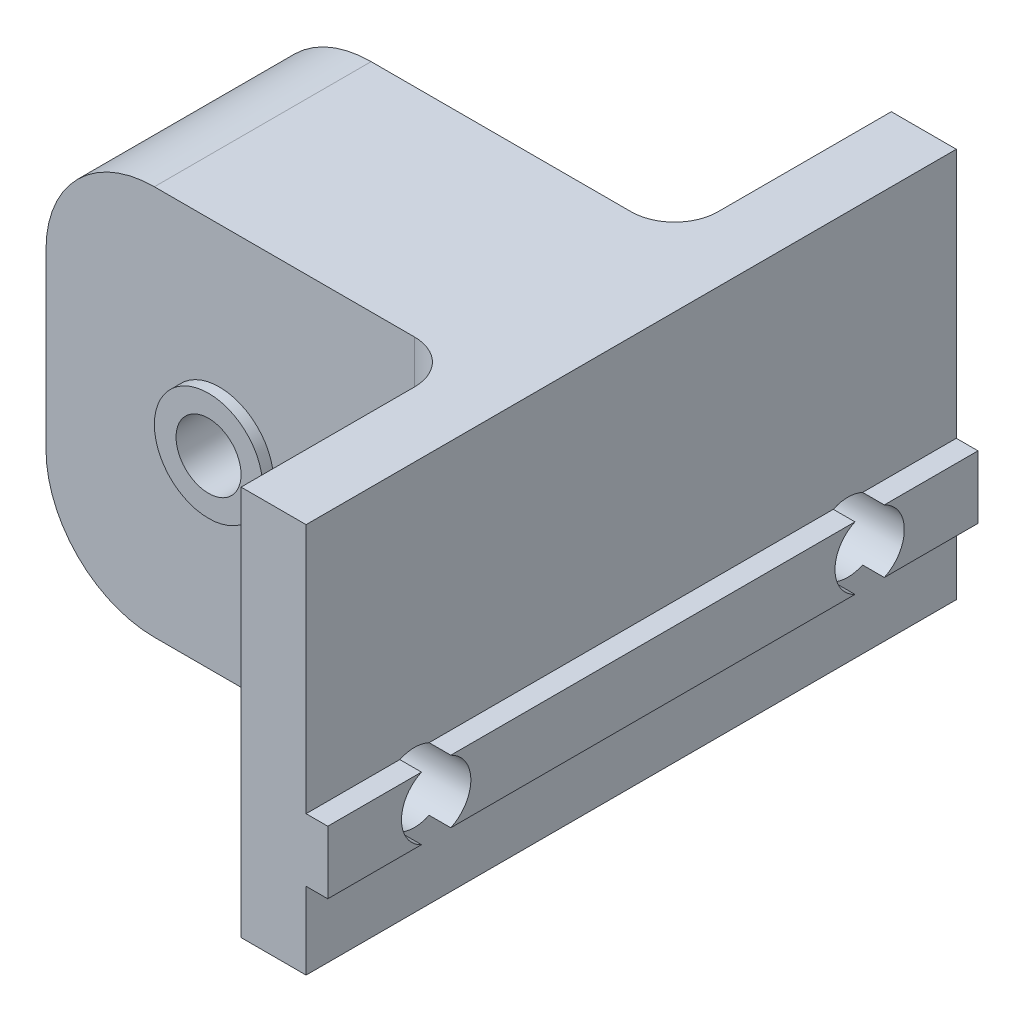
ISO-10303-21;
HEADER;
FILE_DESCRIPTION(('STEP AP214'),'2;1');
FILE_NAME('part.step','',(''),(''),'','','');
FILE_SCHEMA(('AUTOMOTIVE_DESIGN { 1 0 10303 214 1 1 1 1 }'));
ENDSEC;
DATA;
#1=APPLICATION_CONTEXT('core data for automotive mechanical design processes');
#2=APPLICATION_PROTOCOL_DEFINITION('international standard','automotive_design',2000,#1);
#3=PRODUCT_CONTEXT('',#1,'mechanical');
#4=PRODUCT('Part','Part','',(#3));
#5=PRODUCT_RELATED_PRODUCT_CATEGORY('part','',(#4));
#6=PRODUCT_DEFINITION_FORMATION('','',#4);
#7=PRODUCT_DEFINITION_CONTEXT('part definition',#1,'design');
#8=PRODUCT_DEFINITION('design','',#6,#7);
#9=PRODUCT_DEFINITION_SHAPE('','',#8);
#10=(LENGTH_UNIT() NAMED_UNIT(*) SI_UNIT(.MILLI.,.METRE.));
#11=(NAMED_UNIT(*) PLANE_ANGLE_UNIT() SI_UNIT($,.RADIAN.));
#12=(NAMED_UNIT(*) SI_UNIT($,.STERADIAN.) SOLID_ANGLE_UNIT());
#13=UNCERTAINTY_MEASURE_WITH_UNIT(LENGTH_MEASURE(1.E-05),#10,'distance_accuracy_value','');
#14=(GEOMETRIC_REPRESENTATION_CONTEXT(3) GLOBAL_UNCERTAINTY_ASSIGNED_CONTEXT((#13)) GLOBAL_UNIT_ASSIGNED_CONTEXT((#10,
#11,#12)) REPRESENTATION_CONTEXT('',''));
#15=CARTESIAN_POINT('',(0.,0.,0.));
#16=DIRECTION('',(0.,0.,1.));
#17=DIRECTION('',(1.,0.,0.));
#18=AXIS2_PLACEMENT_3D('',#15,#16,#17);
#19=CARTESIAN_POINT('',(-11.,-5.00000000000001,20.));
#20=DIRECTION('',(0.,0.,-1.));
#21=DIRECTION('',(-1.,0.,0.));
#22=AXIS2_PLACEMENT_3D('',#19,#20,#21);
#23=PLANE('',#22);
#24=DIRECTION('',(0.,1.,0.));
#25=VECTOR('',#24,1.);
#26=CARTESIAN_POINT('',(-11.,-5.00000000000001,20.));
#27=LINE('',#26,#25);
#28=CARTESIAN_POINT('',(-11.,0.,20.));
#29=VERTEX_POINT('',#28);
#30=CARTESIAN_POINT('',(-11.,7.99999999999999,20.));
#31=VERTEX_POINT('',#30);
#32=EDGE_CURVE('E360',#29,#31,#27,.T.);
#33=ORIENTED_EDGE('',*,*,#32,.F.);
#34=CARTESIAN_POINT('',(-6.,0.,20.));
#35=DIRECTION('',(0.,0.,-1.));
#36=DIRECTION('',(-1.,0.,0.));
#37=AXIS2_PLACEMENT_3D('',#34,#35,#36);
#38=CIRCLE('',#37,5.);
#39=CARTESIAN_POINT('',(-6.,-5.00000000000001,20.));
#40=VERTEX_POINT('',#39);
#41=EDGE_CURVE('E271',#29,#40,#38,.F.);
#42=ORIENTED_EDGE('',*,*,#41,.T.);
#43=DIRECTION('',(-1.,0.,0.));
#44=VECTOR('',#43,1.);
#45=CARTESIAN_POINT('',(-11.,-5.00000000000001,20.));
#46=LINE('',#45,#44);
#47=CARTESIAN_POINT('',(6.,-5.00000000000001,20.));
#48=VERTEX_POINT('',#47);
#49=EDGE_CURVE('E358',#48,#40,#46,.T.);
#50=ORIENTED_EDGE('',*,*,#49,.F.);
#51=DIRECTION('',(0.,1.,0.));
#52=VECTOR('',#51,1.);
#53=CARTESIAN_POINT('',(6.,13.,20.));
#54=LINE('',#53,#52);
#55=CARTESIAN_POINT('',(6.,13.,20.));
#56=VERTEX_POINT('',#55);
#57=EDGE_CURVE('E244',#48,#56,#54,.T.);
#58=ORIENTED_EDGE('',*,*,#57,.T.);
#59=DIRECTION('',(-1.,0.,0.));
#60=VECTOR('',#59,1.);
#61=CARTESIAN_POINT('',(-11.,13.,20.));
#62=LINE('',#61,#60);
#63=CARTESIAN_POINT('',(-6.,13.,20.));
#64=VERTEX_POINT('',#63);
#65=EDGE_CURVE('E367',#56,#64,#62,.T.);
#66=ORIENTED_EDGE('',*,*,#65,.T.);
#67=CARTESIAN_POINT('',(-6.,7.99999999999999,20.));
#68=DIRECTION('',(0.,0.,-1.));
#69=DIRECTION('',(-1.,0.,0.));
#70=AXIS2_PLACEMENT_3D('',#67,#68,#69);
#71=CIRCLE('',#70,5.);
#72=EDGE_CURVE('E54',#64,#31,#71,.F.);
#73=ORIENTED_EDGE('',*,*,#72,.T.);
#74=EDGE_LOOP('',(#33,#42,#50,#58,#66,#73));
#75=FACE_BOUND('',#74,.T.);
#76=CARTESIAN_POINT('',(-3.,3.99999999999999,20.));
#77=DIRECTION('',(0.,0.,-1.));
#78=DIRECTION('',(-1.,0.,0.));
#79=AXIS2_PLACEMENT_3D('',#76,#77,#78);
#80=CIRCLE('',#79,2.5);
#81=CARTESIAN_POINT('',(-5.5,3.99999999999999,20.));
#82=VERTEX_POINT('',#81);
#83=EDGE_CURVE('E11',#82,#82,#80,.F.);
#84=ORIENTED_EDGE('',*,*,#83,.F.);
#85=EDGE_LOOP('',(#84));
#86=FACE_BOUND('',#85,.T.);
#87=ADVANCED_FACE('F32',(#75,#86),#23,.F.);
#88=CARTESIAN_POINT('',(-11.,-5.00000000000001,10.));
#89=DIRECTION('',(0.,0.,1.));
#90=DIRECTION('',(1.,0.,0.));
#91=AXIS2_PLACEMENT_3D('',#88,#89,#90);
#92=PLANE('',#91);
#93=DIRECTION('',(1.,0.,0.));
#94=VECTOR('',#93,1.);
#95=CARTESIAN_POINT('',(-11.,-5.00000000000001,10.));
#96=LINE('',#95,#94);
#97=CARTESIAN_POINT('',(-6.,-5.00000000000001,10.));
#98=VERTEX_POINT('',#97);
#99=CARTESIAN_POINT('',(6.,-5.00000000000001,10.));
#100=VERTEX_POINT('',#99);
#101=EDGE_CURVE('E378',#98,#100,#96,.T.);
#102=ORIENTED_EDGE('',*,*,#101,.F.);
#103=CARTESIAN_POINT('',(-6.,0.,10.));
#104=DIRECTION('',(0.,0.,1.));
#105=DIRECTION('',(1.,0.,0.));
#106=AXIS2_PLACEMENT_3D('',#103,#104,#105);
#107=CIRCLE('',#106,5.);
#108=CARTESIAN_POINT('',(-11.,0.,10.));
#109=VERTEX_POINT('',#108);
#110=EDGE_CURVE('E263',#98,#109,#107,.F.);
#111=ORIENTED_EDGE('',*,*,#110,.T.);
#112=DIRECTION('',(0.,1.,0.));
#113=VECTOR('',#112,1.);
#114=CARTESIAN_POINT('',(-11.,-5.00000000000001,10.));
#115=LINE('',#114,#113);
#116=CARTESIAN_POINT('',(-11.,7.99999999999999,10.));
#117=VERTEX_POINT('',#116);
#118=EDGE_CURVE('E383',#109,#117,#115,.T.);
#119=ORIENTED_EDGE('',*,*,#118,.T.);
#120=CARTESIAN_POINT('',(-6.,7.99999999999999,10.));
#121=DIRECTION('',(0.,0.,1.));
#122=DIRECTION('',(1.,0.,0.));
#123=AXIS2_PLACEMENT_3D('',#120,#121,#122);
#124=CIRCLE('',#123,5.);
#125=CARTESIAN_POINT('',(-6.,13.,10.));
#126=VERTEX_POINT('',#125);
#127=EDGE_CURVE('E261',#117,#126,#124,.F.);
#128=ORIENTED_EDGE('',*,*,#127,.T.);
#129=DIRECTION('',(1.,0.,0.));
#130=VECTOR('',#129,1.);
#131=CARTESIAN_POINT('',(-11.,13.,10.));
#132=LINE('',#131,#130);
#133=CARTESIAN_POINT('',(6.,13.,10.));
#134=VERTEX_POINT('',#133);
#135=EDGE_CURVE('E376',#126,#134,#132,.T.);
#136=ORIENTED_EDGE('',*,*,#135,.T.);
#137=DIRECTION('',(0.,1.,0.));
#138=VECTOR('',#137,1.);
#139=CARTESIAN_POINT('',(6.,-5.00000000000001,10.));
#140=LINE('',#139,#138);
#141=EDGE_CURVE('E241',#134,#100,#140,.F.);
#142=ORIENTED_EDGE('',*,*,#141,.T.);
#143=EDGE_LOOP('',(#102,#111,#119,#128,#136,#142));
#144=FACE_BOUND('',#143,.T.);
#145=CARTESIAN_POINT('',(-3.,3.99999999999999,10.));
#146=DIRECTION('',(0.,0.,1.));
#147=DIRECTION('',(1.,0.,0.));
#148=AXIS2_PLACEMENT_3D('',#145,#146,#147);
#149=CIRCLE('',#148,2.5);
#150=CARTESIAN_POINT('',(-0.5,3.99999999999999,10.));
#151=VERTEX_POINT('',#150);
#152=EDGE_CURVE('E40',#151,#151,#149,.F.);
#153=ORIENTED_EDGE('',*,*,#152,.F.);
#154=EDGE_LOOP('',(#153));
#155=FACE_BOUND('',#154,.T.);
#156=ADVANCED_FACE('F278',(#144,#155),#92,.F.);
#157=CARTESIAN_POINT('',(12.,-1.45,30.));
#158=DIRECTION('',(0.,1.,0.));
#159=DIRECTION('',(-1.,0.,0.));
#160=AXIS2_PLACEMENT_3D('',#157,#158,#159);
#161=PLANE('',#160);
#162=DIRECTION('',(0.,0.,-1.));
#163=VECTOR('',#162,1.);
#164=CARTESIAN_POINT('',(12.,-1.45,30.));
#165=LINE('',#164,#163);
#166=CARTESIAN_POINT('',(12.,-1.45,4.32361253707657));
#167=VERTEX_POINT('',#166);
#168=CARTESIAN_POINT('',(12.,-1.45,0.));
#169=VERTEX_POINT('',#168);
#170=EDGE_CURVE('E224',#167,#169,#165,.T.);
#171=ORIENTED_EDGE('',*,*,#170,.F.);
#172=DIRECTION('',(-1.,0.,0.));
#173=VECTOR('',#172,1.);
#174=CARTESIAN_POINT('',(12.,-1.45,4.32361253707657));
#175=LINE('',#174,#173);
#176=CARTESIAN_POINT('',(11.,-1.45,4.32361253707657));
#177=VERTEX_POINT('',#176);
#178=EDGE_CURVE('E217',#167,#177,#175,.T.);
#179=ORIENTED_EDGE('',*,*,#178,.T.);
#180=DIRECTION('',(0.,0.,-1.));
#181=VECTOR('',#180,1.);
#182=CARTESIAN_POINT('',(11.,-1.45,30.));
#183=LINE('',#182,#181);
#184=CARTESIAN_POINT('',(11.,-1.45,0.));
#185=VERTEX_POINT('',#184);
#186=EDGE_CURVE('E227',#177,#185,#183,.T.);
#187=ORIENTED_EDGE('',*,*,#186,.T.);
#188=DIRECTION('',(1.,0.,0.));
#189=VECTOR('',#188,1.);
#190=CARTESIAN_POINT('',(12.,-1.45,0.));
#191=LINE('',#190,#189);
#192=EDGE_CURVE('E413',#185,#169,#191,.T.);
#193=ORIENTED_EDGE('',*,*,#192,.T.);
#194=EDGE_LOOP('',(#171,#179,#187,#193));
#195=FACE_BOUND('',#194,.T.);
#196=ADVANCED_FACE('F280',(#195),#161,.F.);
#197=CARTESIAN_POINT('',(12.,1.45,30.));
#198=DIRECTION('',(-1.,0.,0.));
#199=DIRECTION('',(0.,0.,1.));
#200=AXIS2_PLACEMENT_3D('',#197,#198,#199);
#201=PLANE('',#200);
#202=DIRECTION('',(0.,0.,-1.));
#203=VECTOR('',#202,1.);
#204=CARTESIAN_POINT('',(12.,1.45,30.));
#205=LINE('',#204,#203);
#206=CARTESIAN_POINT('',(12.,1.45,4.32361253707657));
#207=VERTEX_POINT('',#206);
#208=CARTESIAN_POINT('',(12.,1.45,0.));
#209=VERTEX_POINT('',#208);
#210=EDGE_CURVE('E430',#207,#209,#205,.T.);
#211=ORIENTED_EDGE('',*,*,#210,.F.);
#212=CARTESIAN_POINT('',(12.,0.,5.));
#213=DIRECTION('',(-1.,0.,0.));
#214=DIRECTION('',(0.,-1.,0.));
#215=AXIS2_PLACEMENT_3D('',#212,#213,#214);
#216=CIRCLE('',#215,1.6);
#217=EDGE_CURVE('E207',#207,#167,#216,.T.);
#218=ORIENTED_EDGE('',*,*,#217,.T.);
#219=ORIENTED_EDGE('',*,*,#170,.T.);
#220=DIRECTION('',(0.,1.,0.));
#221=VECTOR('',#220,1.);
#222=CARTESIAN_POINT('',(12.,1.45,0.));
#223=LINE('',#222,#221);
#224=EDGE_CURVE('E416',#169,#209,#223,.T.);
#225=ORIENTED_EDGE('',*,*,#224,.T.);
#226=EDGE_LOOP('',(#211,#218,#219,#225));
#227=FACE_BOUND('',#226,.T.);
#228=ADVANCED_FACE('F287',(#227),#201,.F.);
#229=CARTESIAN_POINT('',(11.,1.45,30.));
#230=DIRECTION('',(0.,-1.,0.));
#231=DIRECTION('',(1.,0.,0.));
#232=AXIS2_PLACEMENT_3D('',#229,#230,#231);
#233=PLANE('',#232);
#234=CARTESIAN_POINT('',(12.,1.45,24.3236125370766));
#235=VERTEX_POINT('',#234);
#236=CARTESIAN_POINT('',(12.,1.45,5.67638746292344));
#237=VERTEX_POINT('',#236);
#238=EDGE_CURVE('E435',#235,#237,#205,.T.);
#239=ORIENTED_EDGE('',*,*,#238,.T.);
#240=DIRECTION('',(-1.,0.,0.));
#241=VECTOR('',#240,1.);
#242=CARTESIAN_POINT('',(12.,1.45,5.67638746292344));
#243=LINE('',#242,#241);
#244=CARTESIAN_POINT('',(11.,1.45,5.67638746292344));
#245=VERTEX_POINT('',#244);
#246=EDGE_CURVE('E201',#237,#245,#243,.T.);
#247=ORIENTED_EDGE('',*,*,#246,.T.);
#248=DIRECTION('',(0.,0.,-1.));
#249=VECTOR('',#248,1.);
#250=CARTESIAN_POINT('',(11.,1.45,30.));
#251=LINE('',#250,#249);
#252=CARTESIAN_POINT('',(11.,1.45,24.3236125370766));
#253=VERTEX_POINT('',#252);
#254=EDGE_CURVE('E431',#253,#245,#251,.T.);
#255=ORIENTED_EDGE('',*,*,#254,.F.);
#256=DIRECTION('',(-1.,0.,0.));
#257=VECTOR('',#256,1.);
#258=CARTESIAN_POINT('',(12.,1.45,24.3236125370766));
#259=LINE('',#258,#257);
#260=EDGE_CURVE('E462',#253,#235,#259,.F.);
#261=ORIENTED_EDGE('',*,*,#260,.T.);
#262=EDGE_LOOP('',(#239,#247,#255,#261));
#263=FACE_BOUND('',#262,.T.);
#264=ADVANCED_FACE('F321',(#263),#233,.F.);
#265=CARTESIAN_POINT('',(11.,-1.45,24.3236125370766));
#266=VERTEX_POINT('',#265);
#267=CARTESIAN_POINT('',(11.,-1.45,5.67638746292344));
#268=VERTEX_POINT('',#267);
#269=EDGE_CURVE('E216',#266,#268,#183,.T.);
#270=ORIENTED_EDGE('',*,*,#269,.T.);
#271=DIRECTION('',(-1.,0.,0.));
#272=VECTOR('',#271,1.);
#273=CARTESIAN_POINT('',(12.,-1.45,5.67638746292343));
#274=LINE('',#273,#272);
#275=CARTESIAN_POINT('',(12.,-1.45,5.67638746292343));
#276=VERTEX_POINT('',#275);
#277=EDGE_CURVE('E198',#268,#276,#274,.F.);
#278=ORIENTED_EDGE('',*,*,#277,.T.);
#279=CARTESIAN_POINT('',(12.,-1.45,24.3236125370766));
#280=VERTEX_POINT('',#279);
#281=EDGE_CURVE('E214',#280,#276,#165,.T.);
#282=ORIENTED_EDGE('',*,*,#281,.F.);
#283=DIRECTION('',(-1.,0.,0.));
#284=VECTOR('',#283,1.);
#285=CARTESIAN_POINT('',(12.,-1.45,24.3236125370766));
#286=LINE('',#285,#284);
#287=EDGE_CURVE('E374',#280,#266,#286,.T.);
#288=ORIENTED_EDGE('',*,*,#287,.T.);
#289=EDGE_LOOP('',(#270,#278,#282,#288));
#290=FACE_BOUND('',#289,.T.);
#291=ADVANCED_FACE('F212',(#290),#161,.F.);
#292=ORIENTED_EDGE('',*,*,#281,.T.);
#293=EDGE_CURVE('E195',#276,#237,#216,.T.);
#294=ORIENTED_EDGE('',*,*,#293,.T.);
#295=ORIENTED_EDGE('',*,*,#238,.F.);
#296=CARTESIAN_POINT('',(12.,0.,25.));
#297=DIRECTION('',(-1.,0.,0.));
#298=DIRECTION('',(0.,-1.,0.));
#299=AXIS2_PLACEMENT_3D('',#296,#297,#298);
#300=CIRCLE('',#299,1.6);
#301=EDGE_CURVE('E222',#235,#280,#300,.T.);
#302=ORIENTED_EDGE('',*,*,#301,.T.);
#303=EDGE_LOOP('',(#292,#294,#295,#302));
#304=FACE_BOUND('',#303,.T.);
#305=ADVANCED_FACE('F221',(#304),#201,.F.);
#306=CARTESIAN_POINT('',(12.,1.45,30.));
#307=VERTEX_POINT('',#306);
#308=CARTESIAN_POINT('',(12.,1.45,25.6763874629234));
#309=VERTEX_POINT('',#308);
#310=EDGE_CURVE('E228',#307,#309,#205,.T.);
#311=ORIENTED_EDGE('',*,*,#310,.T.);
#312=DIRECTION('',(-1.,0.,0.));
#313=VECTOR('',#312,1.);
#314=CARTESIAN_POINT('',(12.,1.45,25.6763874629234));
#315=LINE('',#314,#313);
#316=CARTESIAN_POINT('',(11.,1.45,25.6763874629234));
#317=VERTEX_POINT('',#316);
#318=EDGE_CURVE('E458',#309,#317,#315,.T.);
#319=ORIENTED_EDGE('',*,*,#318,.T.);
#320=CARTESIAN_POINT('',(11.,1.45,30.));
#321=VERTEX_POINT('',#320);
#322=EDGE_CURVE('E428',#321,#317,#251,.T.);
#323=ORIENTED_EDGE('',*,*,#322,.F.);
#324=DIRECTION('',(-1.,0.,0.));
#325=VECTOR('',#324,1.);
#326=CARTESIAN_POINT('',(11.,1.45,30.));
#327=LINE('',#326,#325);
#328=EDGE_CURVE('E401',#307,#321,#327,.T.);
#329=ORIENTED_EDGE('',*,*,#328,.F.);
#330=EDGE_LOOP('',(#311,#319,#323,#329));
#331=FACE_BOUND('',#330,.T.);
#332=ADVANCED_FACE('F322',(#331),#233,.F.);
#333=CARTESIAN_POINT('',(11.,-5.,30.));
#334=DIRECTION('',(0.,1.,0.));
#335=DIRECTION('',(-1.,0.,0.));
#336=AXIS2_PLACEMENT_3D('',#333,#334,#335);
#337=PLANE('',#336);
#338=ORIENTED_EDGE('',*,*,#49,.T.);
#339=DIRECTION('',(0.,0.,-1.));
#340=VECTOR('',#339,1.);
#341=CARTESIAN_POINT('',(-6.,-5.00000000000001,30.));
#342=LINE('',#341,#340);
#343=EDGE_CURVE('E258',#40,#98,#342,.T.);
#344=ORIENTED_EDGE('',*,*,#343,.T.);
#345=ORIENTED_EDGE('',*,*,#101,.T.);
#346=CARTESIAN_POINT('',(6.,-5.,8.));
#347=DIRECTION('',(0.,1.,0.));
#348=DIRECTION('',(-1.,0.,0.));
#349=AXIS2_PLACEMENT_3D('',#346,#347,#348);
#350=CIRCLE('',#349,2.);
#351=CARTESIAN_POINT('',(8.,-5.00000000000001,8.));
#352=VERTEX_POINT('',#351);
#353=EDGE_CURVE('E252',#100,#352,#350,.T.);
#354=ORIENTED_EDGE('',*,*,#353,.T.);
#355=DIRECTION('',(0.,0.,-1.));
#356=VECTOR('',#355,1.);
#357=CARTESIAN_POINT('',(8.,-5.00000000000001,0.));
#358=LINE('',#357,#356);
#359=CARTESIAN_POINT('',(8.,-5.00000000000001,0.));
#360=VERTEX_POINT('',#359);
#361=EDGE_CURVE('E380',#352,#360,#358,.T.);
#362=ORIENTED_EDGE('',*,*,#361,.T.);
#363=DIRECTION('',(1.,0.,0.));
#364=VECTOR('',#363,1.);
#365=CARTESIAN_POINT('',(11.,-5.,0.));
#366=LINE('',#365,#364);
#367=CARTESIAN_POINT('',(11.,-5.,0.));
#368=VERTEX_POINT('',#367);
#369=EDGE_CURVE('E389',#360,#368,#366,.T.);
#370=ORIENTED_EDGE('',*,*,#369,.T.);
#371=DIRECTION('',(0.,0.,-1.));
#372=VECTOR('',#371,1.);
#373=CARTESIAN_POINT('',(11.,-5.,30.));
#374=LINE('',#373,#372);
#375=CARTESIAN_POINT('',(11.,-5.,30.));
#376=VERTEX_POINT('',#375);
#377=EDGE_CURVE('E235',#376,#368,#374,.T.);
#378=ORIENTED_EDGE('',*,*,#377,.F.);
#379=DIRECTION('',(1.,0.,0.));
#380=VECTOR('',#379,1.);
#381=CARTESIAN_POINT('',(11.,-5.,30.));
#382=LINE('',#381,#380);
#383=CARTESIAN_POINT('',(8.,-5.,30.));
#384=VERTEX_POINT('',#383);
#385=EDGE_CURVE('E392',#384,#376,#382,.T.);
#386=ORIENTED_EDGE('',*,*,#385,.F.);
#387=DIRECTION('',(0.,0.,-1.));
#388=VECTOR('',#387,1.);
#389=CARTESIAN_POINT('',(8.,-5.00000000000001,30.));
#390=LINE('',#389,#388);
#391=CARTESIAN_POINT('',(8.,-5.00000000000001,22.));
#392=VERTEX_POINT('',#391);
#393=EDGE_CURVE('E364',#384,#392,#390,.T.);
#394=ORIENTED_EDGE('',*,*,#393,.T.);
#395=CARTESIAN_POINT('',(6.,-5.,22.));
#396=DIRECTION('',(0.,1.,0.));
#397=DIRECTION('',(-1.,0.,0.));
#398=AXIS2_PLACEMENT_3D('',#395,#396,#397);
#399=CIRCLE('',#398,2.);
#400=EDGE_CURVE('E256',#392,#48,#399,.T.);
#401=ORIENTED_EDGE('',*,*,#400,.T.);
#402=EDGE_LOOP('',(#338,#344,#345,#354,#362,#370,#378,#386,#394,#401));
#403=FACE_BOUND('',#402,.T.);
#404=ADVANCED_FACE('F331',(#403),#337,.F.);
#405=CARTESIAN_POINT('',(11.,-1.45,30.));
#406=DIRECTION('',(-1.,0.,0.));
#407=DIRECTION('',(0.,-1.,0.));
#408=AXIS2_PLACEMENT_3D('',#405,#406,#407);
#409=PLANE('',#408);
#410=ORIENTED_EDGE('',*,*,#186,.F.);
#411=CARTESIAN_POINT('',(11.,0.,5.));
#412=DIRECTION('',(-1.,0.,0.));
#413=DIRECTION('',(0.,-1.,0.));
#414=AXIS2_PLACEMENT_3D('',#411,#412,#413);
#415=CIRCLE('',#414,1.6);
#416=EDGE_CURVE('E218',#177,#268,#415,.T.);
#417=ORIENTED_EDGE('',*,*,#416,.T.);
#418=ORIENTED_EDGE('',*,*,#269,.F.);
#419=CARTESIAN_POINT('',(11.,0.,25.));
#420=DIRECTION('',(-1.,0.,0.));
#421=DIRECTION('',(0.,-1.,0.));
#422=AXIS2_PLACEMENT_3D('',#419,#420,#421);
#423=CIRCLE('',#422,1.6);
#424=CARTESIAN_POINT('',(11.,-1.45,25.6763874629234));
#425=VERTEX_POINT('',#424);
#426=EDGE_CURVE('E465',#266,#425,#423,.T.);
#427=ORIENTED_EDGE('',*,*,#426,.T.);
#428=CARTESIAN_POINT('',(11.,-1.45,30.));
#429=VERTEX_POINT('',#428);
#430=EDGE_CURVE('E232',#429,#425,#183,.T.);
#431=ORIENTED_EDGE('',*,*,#430,.F.);
#432=DIRECTION('',(0.,1.,0.));
#433=VECTOR('',#432,1.);
#434=CARTESIAN_POINT('',(11.,-1.45,30.));
#435=LINE('',#434,#433);
#436=EDGE_CURVE('E394',#376,#429,#435,.T.);
#437=ORIENTED_EDGE('',*,*,#436,.F.);
#438=ORIENTED_EDGE('',*,*,#377,.T.);
#439=DIRECTION('',(0.,1.,0.));
#440=VECTOR('',#439,1.);
#441=CARTESIAN_POINT('',(11.,-1.45,0.));
#442=LINE('',#441,#440);
#443=EDGE_CURVE('E410',#368,#185,#442,.T.);
#444=ORIENTED_EDGE('',*,*,#443,.T.);
#445=EDGE_LOOP('',(#410,#417,#418,#427,#431,#437,#438,#444));
#446=FACE_BOUND('',#445,.T.);
#447=ADVANCED_FACE('F327',(#446),#409,.F.);
#448=ORIENTED_EDGE('',*,*,#430,.T.);
#449=DIRECTION('',(-1.,0.,0.));
#450=VECTOR('',#449,1.);
#451=CARTESIAN_POINT('',(12.,-1.45,25.6763874629234));
#452=LINE('',#451,#450);
#453=CARTESIAN_POINT('',(12.,-1.45,25.6763874629234));
#454=VERTEX_POINT('',#453);
#455=EDGE_CURVE('E461',#425,#454,#452,.F.);
#456=ORIENTED_EDGE('',*,*,#455,.T.);
#457=CARTESIAN_POINT('',(12.,-1.45,30.));
#458=VERTEX_POINT('',#457);
#459=EDGE_CURVE('E223',#458,#454,#165,.T.);
#460=ORIENTED_EDGE('',*,*,#459,.F.);
#461=DIRECTION('',(1.,0.,0.));
#462=VECTOR('',#461,1.);
#463=CARTESIAN_POINT('',(12.,-1.45,30.));
#464=LINE('',#463,#462);
#465=EDGE_CURVE('E397',#429,#458,#464,.T.);
#466=ORIENTED_EDGE('',*,*,#465,.F.);
#467=EDGE_LOOP('',(#448,#456,#460,#466));
#468=FACE_BOUND('',#467,.T.);
#469=ADVANCED_FACE('F290',(#468),#161,.F.);
#470=ORIENTED_EDGE('',*,*,#459,.T.);
#471=EDGE_CURVE('E497',#454,#309,#300,.T.);
#472=ORIENTED_EDGE('',*,*,#471,.T.);
#473=ORIENTED_EDGE('',*,*,#310,.F.);
#474=DIRECTION('',(0.,1.,0.));
#475=VECTOR('',#474,1.);
#476=CARTESIAN_POINT('',(12.,1.45,30.));
#477=LINE('',#476,#475);
#478=EDGE_CURVE('E399',#458,#307,#477,.T.);
#479=ORIENTED_EDGE('',*,*,#478,.F.);
#480=EDGE_LOOP('',(#470,#472,#473,#479));
#481=FACE_BOUND('',#480,.T.);
#482=ADVANCED_FACE('F319',(#481),#201,.F.);
#483=CARTESIAN_POINT('',(11.,1.45,4.32361253707657));
#484=VERTEX_POINT('',#483);
#485=CARTESIAN_POINT('',(11.,1.45,0.));
#486=VERTEX_POINT('',#485);
#487=EDGE_CURVE('E427',#484,#486,#251,.T.);
#488=ORIENTED_EDGE('',*,*,#487,.F.);
#489=DIRECTION('',(-1.,0.,0.));
#490=VECTOR('',#489,1.);
#491=CARTESIAN_POINT('',(12.,1.45,4.32361253707657));
#492=LINE('',#491,#490);
#493=EDGE_CURVE('E491',#484,#207,#492,.F.);
#494=ORIENTED_EDGE('',*,*,#493,.T.);
#495=ORIENTED_EDGE('',*,*,#210,.T.);
#496=DIRECTION('',(-1.,0.,0.));
#497=VECTOR('',#496,1.);
#498=CARTESIAN_POINT('',(11.,1.45,0.));
#499=LINE('',#498,#497);
#500=EDGE_CURVE('E419',#209,#486,#499,.T.);
#501=ORIENTED_EDGE('',*,*,#500,.T.);
#502=EDGE_LOOP('',(#488,#494,#495,#501));
#503=FACE_BOUND('',#502,.T.);
#504=ADVANCED_FACE('F315',(#503),#233,.F.);
#505=CARTESIAN_POINT('',(11.,13.,30.));
#506=DIRECTION('',(-1.,0.,0.));
#507=DIRECTION('',(0.,-1.,0.));
#508=AXIS2_PLACEMENT_3D('',#505,#506,#507);
#509=PLANE('',#508);
#510=ORIENTED_EDGE('',*,*,#254,.T.);
#511=CARTESIAN_POINT('',(11.,0.,5.));
#512=DIRECTION('',(-1.,0.,0.));
#513=DIRECTION('',(0.,-1.,0.));
#514=AXIS2_PLACEMENT_3D('',#511,#512,#513);
#515=CIRCLE('',#514,1.6);
#516=EDGE_CURVE('E206',#245,#484,#515,.T.);
#517=ORIENTED_EDGE('',*,*,#516,.T.);
#518=ORIENTED_EDGE('',*,*,#487,.T.);
#519=DIRECTION('',(0.,1.,0.));
#520=VECTOR('',#519,1.);
#521=CARTESIAN_POINT('',(11.,13.,0.));
#522=LINE('',#521,#520);
#523=CARTESIAN_POINT('',(11.,13.,0.));
#524=VERTEX_POINT('',#523);
#525=EDGE_CURVE('E422',#486,#524,#522,.T.);
#526=ORIENTED_EDGE('',*,*,#525,.T.);
#527=DIRECTION('',(0.,0.,-1.));
#528=VECTOR('',#527,1.);
#529=CARTESIAN_POINT('',(11.,13.,30.));
#530=LINE('',#529,#528);
#531=CARTESIAN_POINT('',(11.,13.,30.));
#532=VERTEX_POINT('',#531);
#533=EDGE_CURVE('E408',#532,#524,#530,.T.);
#534=ORIENTED_EDGE('',*,*,#533,.F.);
#535=DIRECTION('',(0.,1.,0.));
#536=VECTOR('',#535,1.);
#537=CARTESIAN_POINT('',(11.,13.,30.));
#538=LINE('',#537,#536);
#539=EDGE_CURVE('E403',#321,#532,#538,.T.);
#540=ORIENTED_EDGE('',*,*,#539,.F.);
#541=ORIENTED_EDGE('',*,*,#322,.T.);
#542=CARTESIAN_POINT('',(11.,0.,25.));
#543=DIRECTION('',(-1.,0.,0.));
#544=DIRECTION('',(0.,-1.,0.));
#545=AXIS2_PLACEMENT_3D('',#542,#543,#544);
#546=CIRCLE('',#545,1.6);
#547=EDGE_CURVE('E468',#317,#253,#546,.T.);
#548=ORIENTED_EDGE('',*,*,#547,.T.);
#549=EDGE_LOOP('',(#510,#517,#518,#526,#534,#540,#541,#548));
#550=FACE_BOUND('',#549,.T.);
#551=ADVANCED_FACE('F312',(#550),#509,.F.);
#552=CARTESIAN_POINT('',(-11.,13.,30.));
#553=DIRECTION('',(0.,-1.,0.));
#554=DIRECTION('',(0.,0.,-1.));
#555=AXIS2_PLACEMENT_3D('',#552,#553,#554);
#556=PLANE('',#555);
#557=ORIENTED_EDGE('',*,*,#135,.F.);
#558=DIRECTION('',(0.,0.,-1.));
#559=VECTOR('',#558,1.);
#560=CARTESIAN_POINT('',(-6.,13.,30.));
#561=LINE('',#560,#559);
#562=EDGE_CURVE('E47',#126,#64,#561,.F.);
#563=ORIENTED_EDGE('',*,*,#562,.T.);
#564=ORIENTED_EDGE('',*,*,#65,.F.);
#565=CARTESIAN_POINT('',(6.,13.,22.));
#566=DIRECTION('',(0.,-1.,0.));
#567=DIRECTION('',(0.,0.,-1.));
#568=AXIS2_PLACEMENT_3D('',#565,#566,#567);
#569=CIRCLE('',#568,2.);
#570=CARTESIAN_POINT('',(8.,13.,22.));
#571=VERTEX_POINT('',#570);
#572=EDGE_CURVE('E254',#56,#571,#569,.T.);
#573=ORIENTED_EDGE('',*,*,#572,.T.);
#574=DIRECTION('',(0.,0.,-1.));
#575=VECTOR('',#574,1.);
#576=CARTESIAN_POINT('',(8.,13.,30.));
#577=LINE('',#576,#575);
#578=CARTESIAN_POINT('',(8.,13.,30.));
#579=VERTEX_POINT('',#578);
#580=EDGE_CURVE('E371',#579,#571,#577,.T.);
#581=ORIENTED_EDGE('',*,*,#580,.F.);
#582=DIRECTION('',(-1.,0.,0.));
#583=VECTOR('',#582,1.);
#584=CARTESIAN_POINT('',(-11.,13.,30.));
#585=LINE('',#584,#583);
#586=EDGE_CURVE('E405',#532,#579,#585,.T.);
#587=ORIENTED_EDGE('',*,*,#586,.F.);
#588=ORIENTED_EDGE('',*,*,#533,.T.);
#589=DIRECTION('',(-1.,0.,0.));
#590=VECTOR('',#589,1.);
#591=CARTESIAN_POINT('',(-11.,13.,0.));
#592=LINE('',#591,#590);
#593=CARTESIAN_POINT('',(8.,13.,0.));
#594=VERTEX_POINT('',#593);
#595=EDGE_CURVE('E395',#524,#594,#592,.T.);
#596=ORIENTED_EDGE('',*,*,#595,.T.);
#597=DIRECTION('',(0.,0.,-1.));
#598=VECTOR('',#597,1.);
#599=CARTESIAN_POINT('',(8.,13.,0.));
#600=LINE('',#599,#598);
#601=CARTESIAN_POINT('',(8.,13.,8.));
#602=VERTEX_POINT('',#601);
#603=EDGE_CURVE('E381',#602,#594,#600,.T.);
#604=ORIENTED_EDGE('',*,*,#603,.F.);
#605=CARTESIAN_POINT('',(6.,13.,8.));
#606=DIRECTION('',(0.,-1.,0.));
#607=DIRECTION('',(0.,0.,-1.));
#608=AXIS2_PLACEMENT_3D('',#605,#606,#607);
#609=CIRCLE('',#608,2.);
#610=EDGE_CURVE('E249',#602,#134,#609,.T.);
#611=ORIENTED_EDGE('',*,*,#610,.T.);
#612=EDGE_LOOP('',(#557,#563,#564,#573,#581,#587,#588,#596,#604,#611));
#613=FACE_BOUND('',#612,.T.);
#614=ADVANCED_FACE('F308',(#613),#556,.F.);
#615=CARTESIAN_POINT('',(-11.,13.,30.));
#616=DIRECTION('',(1.,0.,0.));
#617=DIRECTION('',(0.,0.,-1.));
#618=AXIS2_PLACEMENT_3D('',#615,#616,#617);
#619=PLANE('',#618);
#620=ORIENTED_EDGE('',*,*,#118,.F.);
#621=DIRECTION('',(0.,0.,-1.));
#622=VECTOR('',#621,1.);
#623=CARTESIAN_POINT('',(-11.,0.,30.));
#624=LINE('',#623,#622);
#625=EDGE_CURVE('E268',#109,#29,#624,.F.);
#626=ORIENTED_EDGE('',*,*,#625,.T.);
#627=ORIENTED_EDGE('',*,*,#32,.T.);
#628=DIRECTION('',(0.,0.,-1.));
#629=VECTOR('',#628,1.);
#630=CARTESIAN_POINT('',(-11.,7.99999999999999,30.));
#631=LINE('',#630,#629);
#632=EDGE_CURVE('E265',#31,#117,#631,.T.);
#633=ORIENTED_EDGE('',*,*,#632,.T.);
#634=EDGE_LOOP('',(#620,#626,#627,#633));
#635=FACE_BOUND('',#634,.T.);
#636=ADVANCED_FACE('F301',(#635),#619,.F.);
#637=CARTESIAN_POINT('',(0.,0.,30.));
#638=DIRECTION('',(0.,0.,1.));
#639=DIRECTION('',(1.,0.,0.));
#640=AXIS2_PLACEMENT_3D('',#637,#638,#639);
#641=PLANE('',#640);
#642=DIRECTION('',(0.,1.,0.));
#643=VECTOR('',#642,1.);
#644=CARTESIAN_POINT('',(8.,-5.00000000000001,30.));
#645=LINE('',#644,#643);
#646=EDGE_CURVE('E363',#384,#579,#645,.T.);
#647=ORIENTED_EDGE('',*,*,#646,.F.);
#648=ORIENTED_EDGE('',*,*,#385,.T.);
#649=ORIENTED_EDGE('',*,*,#436,.T.);
#650=ORIENTED_EDGE('',*,*,#465,.T.);
#651=ORIENTED_EDGE('',*,*,#478,.T.);
#652=ORIENTED_EDGE('',*,*,#328,.T.);
#653=ORIENTED_EDGE('',*,*,#539,.T.);
#654=ORIENTED_EDGE('',*,*,#586,.T.);
#655=EDGE_LOOP('',(#647,#648,#649,#650,#651,#652,#653,#654));
#656=FACE_BOUND('',#655,.T.);
#657=ADVANCED_FACE('F297',(#656),#641,.T.);
#658=CARTESIAN_POINT('',(0.,0.,0.));
#659=DIRECTION('',(0.,0.,1.));
#660=DIRECTION('',(1.,0.,0.));
#661=AXIS2_PLACEMENT_3D('',#658,#659,#660);
#662=PLANE('',#661);
#663=ORIENTED_EDGE('',*,*,#369,.F.);
#664=DIRECTION('',(0.,1.,0.));
#665=VECTOR('',#664,1.);
#666=CARTESIAN_POINT('',(8.,-5.00000000000001,0.));
#667=LINE('',#666,#665);
#668=EDGE_CURVE('E386',#360,#594,#667,.T.);
#669=ORIENTED_EDGE('',*,*,#668,.T.);
#670=ORIENTED_EDGE('',*,*,#595,.F.);
#671=ORIENTED_EDGE('',*,*,#525,.F.);
#672=ORIENTED_EDGE('',*,*,#500,.F.);
#673=ORIENTED_EDGE('',*,*,#224,.F.);
#674=ORIENTED_EDGE('',*,*,#192,.F.);
#675=ORIENTED_EDGE('',*,*,#443,.F.);
#676=EDGE_LOOP('',(#663,#669,#670,#671,#672,#673,#674,#675));
#677=FACE_BOUND('',#676,.T.);
#678=ADVANCED_FACE('F300',(#677),#662,.F.);
#679=CARTESIAN_POINT('',(8.,-5.00000000000001,0.));
#680=DIRECTION('',(1.,0.,0.));
#681=DIRECTION('',(0.,0.,-1.));
#682=AXIS2_PLACEMENT_3D('',#679,#680,#681);
#683=PLANE('',#682);
#684=CARTESIAN_POINT('',(8.,0.,5.));
#685=DIRECTION('',(-1.,0.,0.));
#686=DIRECTION('',(0.,-1.,0.));
#687=AXIS2_PLACEMENT_3D('',#684,#685,#686);
#688=CIRCLE('',#687,1.6);
#689=CARTESIAN_POINT('',(8.,-1.6,5.));
#690=VERTEX_POINT('',#689);
#691=EDGE_CURVE('E483',#690,#690,#688,.T.);
#692=ORIENTED_EDGE('',*,*,#691,.F.);
#693=EDGE_LOOP('',(#692));
#694=FACE_BOUND('',#693,.T.);
#695=ORIENTED_EDGE('',*,*,#361,.F.);
#696=DIRECTION('',(0.,1.,0.));
#697=VECTOR('',#696,1.);
#698=CARTESIAN_POINT('',(8.,13.,8.));
#699=LINE('',#698,#697);
#700=EDGE_CURVE('E238',#352,#602,#699,.T.);
#701=ORIENTED_EDGE('',*,*,#700,.T.);
#702=ORIENTED_EDGE('',*,*,#603,.T.);
#703=ORIENTED_EDGE('',*,*,#668,.F.);
#704=EDGE_LOOP('',(#695,#701,#702,#703));
#705=FACE_BOUND('',#704,.T.);
#706=ADVANCED_FACE('F295',(#694,#705),#683,.F.);
#707=CARTESIAN_POINT('',(8.,-5.00000000000001,30.));
#708=DIRECTION('',(1.,0.,0.));
#709=DIRECTION('',(0.,0.,-1.));
#710=AXIS2_PLACEMENT_3D('',#707,#708,#709);
#711=PLANE('',#710);
#712=CARTESIAN_POINT('',(8.,0.,25.));
#713=DIRECTION('',(-1.,0.,0.));
#714=DIRECTION('',(0.,-1.,0.));
#715=AXIS2_PLACEMENT_3D('',#712,#713,#714);
#716=CIRCLE('',#715,1.6);
#717=CARTESIAN_POINT('',(8.,-1.6,25.));
#718=VERTEX_POINT('',#717);
#719=EDGE_CURVE('E496',#718,#718,#716,.T.);
#720=ORIENTED_EDGE('',*,*,#719,.F.);
#721=EDGE_LOOP('',(#720));
#722=FACE_BOUND('',#721,.T.);
#723=ORIENTED_EDGE('',*,*,#580,.T.);
#724=DIRECTION('',(0.,1.,0.));
#725=VECTOR('',#724,1.);
#726=CARTESIAN_POINT('',(8.,-5.00000000000001,22.));
#727=LINE('',#726,#725);
#728=EDGE_CURVE('E247',#571,#392,#727,.F.);
#729=ORIENTED_EDGE('',*,*,#728,.T.);
#730=ORIENTED_EDGE('',*,*,#393,.F.);
#731=ORIENTED_EDGE('',*,*,#646,.T.);
#732=EDGE_LOOP('',(#723,#729,#730,#731));
#733=FACE_BOUND('',#732,.T.);
#734=ADVANCED_FACE('F504',(#722,#733),#711,.F.);
#735=CARTESIAN_POINT('',(12.,0.,25.));
#736=DIRECTION('',(-1.,0.,0.));
#737=DIRECTION('',(0.,-1.,0.));
#738=AXIS2_PLACEMENT_3D('',#735,#736,#737);
#739=CYLINDRICAL_SURFACE('',#738,1.6);
#740=ORIENTED_EDGE('',*,*,#719,.T.);
#741=EDGE_LOOP('',(#740));
#742=FACE_BOUND('',#741,.T.);
#743=ORIENTED_EDGE('',*,*,#301,.F.);
#744=ORIENTED_EDGE('',*,*,#260,.F.);
#745=ORIENTED_EDGE('',*,*,#547,.F.);
#746=ORIENTED_EDGE('',*,*,#318,.F.);
#747=ORIENTED_EDGE('',*,*,#471,.F.);
#748=ORIENTED_EDGE('',*,*,#455,.F.);
#749=ORIENTED_EDGE('',*,*,#426,.F.);
#750=ORIENTED_EDGE('',*,*,#287,.F.);
#751=EDGE_LOOP('',(#743,#744,#745,#746,#747,#748,#749,#750));
#752=FACE_BOUND('',#751,.T.);
#753=ADVANCED_FACE('F502',(#742,#752),#739,.F.);
#754=CARTESIAN_POINT('',(12.,0.,5.));
#755=DIRECTION('',(-1.,0.,0.));
#756=DIRECTION('',(0.,-1.,0.));
#757=AXIS2_PLACEMENT_3D('',#754,#755,#756);
#758=CYLINDRICAL_SURFACE('',#757,1.6);
#759=ORIENTED_EDGE('',*,*,#691,.T.);
#760=EDGE_LOOP('',(#759));
#761=FACE_BOUND('',#760,.T.);
#762=ORIENTED_EDGE('',*,*,#217,.F.);
#763=ORIENTED_EDGE('',*,*,#493,.F.);
#764=ORIENTED_EDGE('',*,*,#516,.F.);
#765=ORIENTED_EDGE('',*,*,#246,.F.);
#766=ORIENTED_EDGE('',*,*,#293,.F.);
#767=ORIENTED_EDGE('',*,*,#277,.F.);
#768=ORIENTED_EDGE('',*,*,#416,.F.);
#769=ORIENTED_EDGE('',*,*,#178,.F.);
#770=EDGE_LOOP('',(#762,#763,#764,#765,#766,#767,#768,#769));
#771=FACE_BOUND('',#770,.T.);
#772=ADVANCED_FACE('F197',(#761,#771),#758,.F.);
#773=CARTESIAN_POINT('',(-3.,3.99999999999999,0.));
#774=DIRECTION('',(0.,0.,1.));
#775=DIRECTION('',(1.,0.,0.));
#776=AXIS2_PLACEMENT_3D('',#773,#774,#775);
#777=CYLINDRICAL_SURFACE('',#776,1.5);
#778=CARTESIAN_POINT('',(-3.,3.99999999999999,9.5));
#779=DIRECTION('',(0.,0.,-1.));
#780=DIRECTION('',(-1.,0.,0.));
#781=AXIS2_PLACEMENT_3D('',#778,#779,#780);
#782=CIRCLE('',#781,1.5);
#783=CARTESIAN_POINT('',(-4.5,3.99999999999999,9.5));
#784=VERTEX_POINT('',#783);
#785=EDGE_CURVE('E542',#784,#784,#782,.T.);
#786=ORIENTED_EDGE('',*,*,#785,.T.);
#787=EDGE_LOOP('',(#786));
#788=FACE_BOUND('',#787,.T.);
#789=CARTESIAN_POINT('',(-3.,3.99999999999999,20.5));
#790=DIRECTION('',(0.,0.,1.));
#791=DIRECTION('',(1.,0.,0.));
#792=AXIS2_PLACEMENT_3D('',#789,#790,#791);
#793=CIRCLE('',#792,1.5);
#794=CARTESIAN_POINT('',(-1.5,3.99999999999999,20.5));
#795=VERTEX_POINT('',#794);
#796=EDGE_CURVE('E539',#795,#795,#793,.T.);
#797=ORIENTED_EDGE('',*,*,#796,.T.);
#798=EDGE_LOOP('',(#797));
#799=FACE_BOUND('',#798,.T.);
#800=ADVANCED_FACE('F340',(#788,#799),#777,.F.);
#801=CARTESIAN_POINT('',(6.,-5.00000000000001,8.));
#802=DIRECTION('',(0.,-1.,0.));
#803=DIRECTION('',(1.,0.,0.));
#804=AXIS2_PLACEMENT_3D('',#801,#802,#803);
#805=CYLINDRICAL_SURFACE('',#804,2.);
#806=ORIENTED_EDGE('',*,*,#353,.F.);
#807=ORIENTED_EDGE('',*,*,#141,.F.);
#808=ORIENTED_EDGE('',*,*,#610,.F.);
#809=ORIENTED_EDGE('',*,*,#700,.F.);
#810=EDGE_LOOP('',(#806,#807,#808,#809));
#811=FACE_BOUND('',#810,.T.);
#812=ADVANCED_FACE('F336',(#811),#805,.F.);
#813=CARTESIAN_POINT('',(6.,-5.00000000000001,22.));
#814=DIRECTION('',(0.,-1.,0.));
#815=DIRECTION('',(1.,0.,0.));
#816=AXIS2_PLACEMENT_3D('',#813,#814,#815);
#817=CYLINDRICAL_SURFACE('',#816,2.);
#818=ORIENTED_EDGE('',*,*,#400,.F.);
#819=ORIENTED_EDGE('',*,*,#728,.F.);
#820=ORIENTED_EDGE('',*,*,#572,.F.);
#821=ORIENTED_EDGE('',*,*,#57,.F.);
#822=EDGE_LOOP('',(#818,#819,#820,#821));
#823=FACE_BOUND('',#822,.T.);
#824=ADVANCED_FACE('F339',(#823),#817,.F.);
#825=CARTESIAN_POINT('',(-6.,0.,30.));
#826=DIRECTION('',(0.,0.,-1.));
#827=DIRECTION('',(-1.,0.,0.));
#828=AXIS2_PLACEMENT_3D('',#825,#826,#827);
#829=CYLINDRICAL_SURFACE('',#828,5.);
#830=ORIENTED_EDGE('',*,*,#41,.F.);
#831=ORIENTED_EDGE('',*,*,#625,.F.);
#832=ORIENTED_EDGE('',*,*,#110,.F.);
#833=ORIENTED_EDGE('',*,*,#343,.F.);
#834=EDGE_LOOP('',(#830,#831,#832,#833));
#835=FACE_BOUND('',#834,.T.);
#836=ADVANCED_FACE('F343',(#835),#829,.T.);
#837=CARTESIAN_POINT('',(-6.,7.99999999999999,30.));
#838=DIRECTION('',(0.,0.,-1.));
#839=DIRECTION('',(-1.,0.,0.));
#840=AXIS2_PLACEMENT_3D('',#837,#838,#839);
#841=CYLINDRICAL_SURFACE('',#840,5.);
#842=ORIENTED_EDGE('',*,*,#72,.F.);
#843=ORIENTED_EDGE('',*,*,#562,.F.);
#844=ORIENTED_EDGE('',*,*,#127,.F.);
#845=ORIENTED_EDGE('',*,*,#632,.F.);
#846=EDGE_LOOP('',(#842,#843,#844,#845));
#847=FACE_BOUND('',#846,.T.);
#848=ADVANCED_FACE('F34',(#847),#841,.T.);
#849=CARTESIAN_POINT('',(-3.,3.99999999999999,9.5));
#850=DIRECTION('',(0.,0.,-1.));
#851=DIRECTION('',(-1.,0.,0.));
#852=AXIS2_PLACEMENT_3D('',#849,#850,#851);
#853=PLANE('',#852);
#854=CARTESIAN_POINT('',(-3.,3.99999999999999,9.5));
#855=DIRECTION('',(0.,0.,-1.));
#856=DIRECTION('',(-1.,0.,0.));
#857=AXIS2_PLACEMENT_3D('',#854,#855,#856);
#858=CIRCLE('',#857,2.5);
#859=CARTESIAN_POINT('',(-5.5,3.99999999999999,9.5));
#860=VERTEX_POINT('',#859);
#861=EDGE_CURVE('E485',#860,#860,#858,.T.);
#862=ORIENTED_EDGE('',*,*,#861,.T.);
#863=EDGE_LOOP('',(#862));
#864=FACE_BOUND('',#863,.T.);
#865=ORIENTED_EDGE('',*,*,#785,.F.);
#866=EDGE_LOOP('',(#865));
#867=FACE_BOUND('',#866,.T.);
#868=ADVANCED_FACE('F350',(#864,#867),#853,.T.);
#869=CARTESIAN_POINT('',(-3.,3.99999999999999,9.5));
#870=DIRECTION('',(0.,0.,1.));
#871=DIRECTION('',(1.,0.,0.));
#872=AXIS2_PLACEMENT_3D('',#869,#870,#871);
#873=CYLINDRICAL_SURFACE('',#872,2.5);
#874=ORIENTED_EDGE('',*,*,#861,.F.);
#875=EDGE_LOOP('',(#874));
#876=FACE_BOUND('',#875,.T.);
#877=ORIENTED_EDGE('',*,*,#152,.T.);
#878=EDGE_LOOP('',(#877));
#879=FACE_BOUND('',#878,.T.);
#880=ADVANCED_FACE('F276',(#876,#879),#873,.T.);
#881=CARTESIAN_POINT('',(-3.,3.99999999999999,20.5));
#882=DIRECTION('',(0.,0.,1.));
#883=DIRECTION('',(1.,0.,0.));
#884=AXIS2_PLACEMENT_3D('',#881,#882,#883);
#885=PLANE('',#884);
#886=CARTESIAN_POINT('',(-3.,3.99999999999999,20.5));
#887=DIRECTION('',(0.,0.,1.));
#888=DIRECTION('',(1.,0.,0.));
#889=AXIS2_PLACEMENT_3D('',#886,#887,#888);
#890=CIRCLE('',#889,2.5);
#891=CARTESIAN_POINT('',(-0.499999999999998,3.99999999999999,20.5));
#892=VERTEX_POINT('',#891);
#893=EDGE_CURVE('E536',#892,#892,#890,.T.);
#894=ORIENTED_EDGE('',*,*,#893,.T.);
#895=EDGE_LOOP('',(#894));
#896=FACE_BOUND('',#895,.T.);
#897=ORIENTED_EDGE('',*,*,#796,.F.);
#898=EDGE_LOOP('',(#897));
#899=FACE_BOUND('',#898,.T.);
#900=ADVANCED_FACE('F520',(#896,#899),#885,.T.);
#901=CARTESIAN_POINT('',(-3.,3.99999999999999,20.5));
#902=DIRECTION('',(0.,0.,-1.));
#903=DIRECTION('',(-1.,0.,0.));
#904=AXIS2_PLACEMENT_3D('',#901,#902,#903);
#905=CYLINDRICAL_SURFACE('',#904,2.5);
#906=ORIENTED_EDGE('',*,*,#893,.F.);
#907=EDGE_LOOP('',(#906));
#908=FACE_BOUND('',#907,.T.);
#909=ORIENTED_EDGE('',*,*,#83,.T.);
#910=EDGE_LOOP('',(#909));
#911=FACE_BOUND('',#910,.T.);
#912=ADVANCED_FACE('F525',(#908,#911),#905,.T.);
#913=CLOSED_SHELL('',(#87,#156,#196,#228,#264,#291,#305,#332,#404,#447,#469,#482,#504,#551,#614,
#636,#657,#678,#706,#734,#753,#772,#800,#812,#824,#836,#848,#868,#880,#900,#912));
#914=MANIFOLD_SOLID_BREP('B2',#913);
#915=ADVANCED_BREP_SHAPE_REPRESENTATION('',(#18,#914),#14);
#916=SHAPE_DEFINITION_REPRESENTATION(#9,#915);
ENDSEC;
END-ISO-10303-21;
